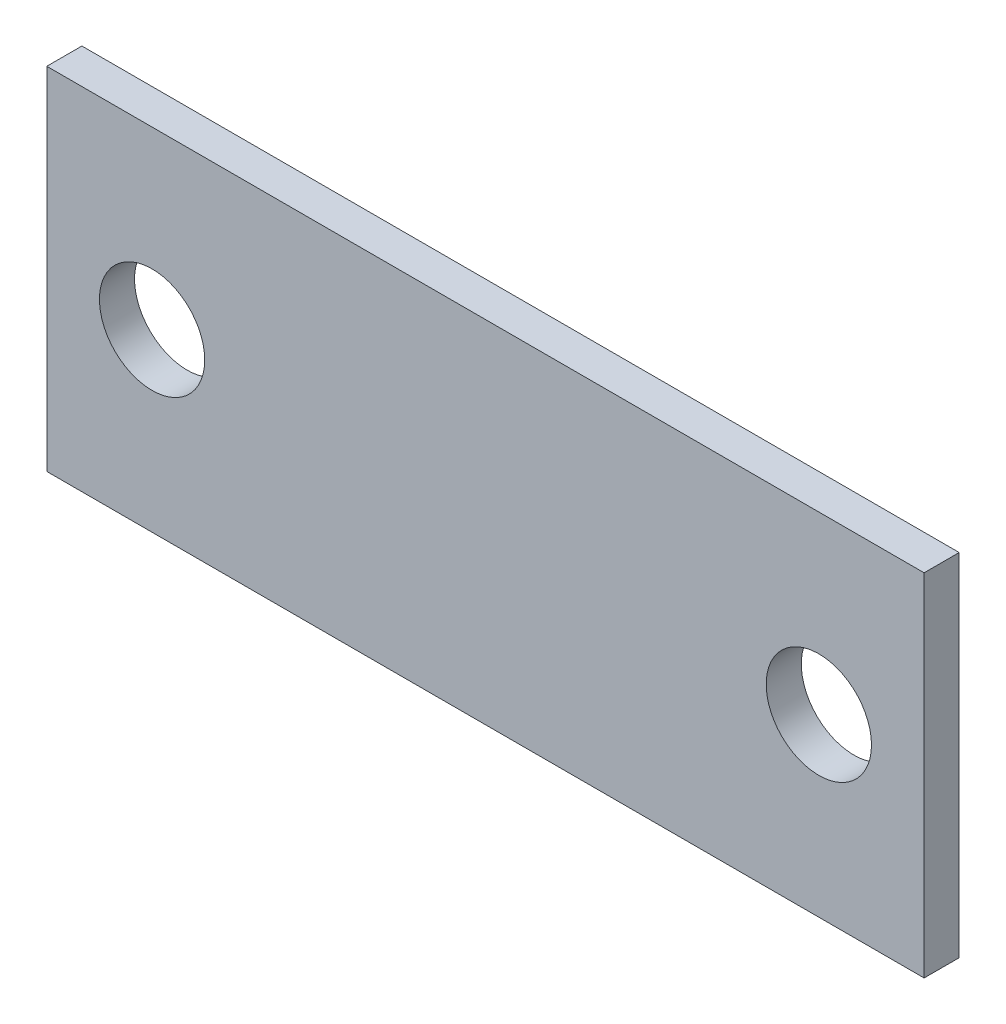
ISO-10303-21;
HEADER;
FILE_DESCRIPTION(('STEP AP214'),'2;1');
FILE_NAME('part.step','',(''),(''),'','','');
FILE_SCHEMA(('AUTOMOTIVE_DESIGN { 1 0 10303 214 1 1 1 1 }'));
ENDSEC;
DATA;
#1=APPLICATION_CONTEXT('core data for automotive mechanical design processes');
#2=APPLICATION_PROTOCOL_DEFINITION('international standard','automotive_design',2000,#1);
#3=PRODUCT_CONTEXT('',#1,'mechanical');
#4=PRODUCT('Part','Part','',(#3));
#5=PRODUCT_RELATED_PRODUCT_CATEGORY('part','',(#4));
#6=PRODUCT_DEFINITION_FORMATION('','',#4);
#7=PRODUCT_DEFINITION_CONTEXT('part definition',#1,'design');
#8=PRODUCT_DEFINITION('design','',#6,#7);
#9=PRODUCT_DEFINITION_SHAPE('','',#8);
#10=(LENGTH_UNIT() NAMED_UNIT(*) SI_UNIT(.MILLI.,.METRE.));
#11=(NAMED_UNIT(*) PLANE_ANGLE_UNIT() SI_UNIT($,.RADIAN.));
#12=(NAMED_UNIT(*) SI_UNIT($,.STERADIAN.) SOLID_ANGLE_UNIT());
#13=UNCERTAINTY_MEASURE_WITH_UNIT(LENGTH_MEASURE(1.E-05),#10,'distance_accuracy_value','');
#14=(GEOMETRIC_REPRESENTATION_CONTEXT(3) GLOBAL_UNCERTAINTY_ASSIGNED_CONTEXT((#13)) GLOBAL_UNIT_ASSIGNED_CONTEXT((#10,
#11,#12)) REPRESENTATION_CONTEXT('',''));
#15=CARTESIAN_POINT('',(0.,0.,0.));
#16=DIRECTION('',(0.,0.,1.));
#17=DIRECTION('',(1.,0.,0.));
#18=AXIS2_PLACEMENT_3D('',#15,#16,#17);
#19=CARTESIAN_POINT('',(0.,0.,10.));
#20=DIRECTION('',(0.,0.,-1.));
#21=DIRECTION('',(-1.,0.,0.));
#22=AXIS2_PLACEMENT_3D('',#19,#20,#21);
#23=PLANE('',#22);
#24=DIRECTION('',(0.,1.,0.));
#25=VECTOR('',#24,1.);
#26=CARTESIAN_POINT('',(125.,-50.,10.));
#27=LINE('',#26,#25);
#28=CARTESIAN_POINT('',(125.,-50.,10.));
#29=VERTEX_POINT('',#28);
#30=CARTESIAN_POINT('',(125.,50.,10.));
#31=VERTEX_POINT('',#30);
#32=EDGE_CURVE('E91',#29,#31,#27,.T.);
#33=ORIENTED_EDGE('',*,*,#32,.T.);
#34=DIRECTION('',(-1.,0.,0.));
#35=VECTOR('',#34,1.);
#36=CARTESIAN_POINT('',(-125.,50.,10.));
#37=LINE('',#36,#35);
#38=CARTESIAN_POINT('',(-125.,50.,10.));
#39=VERTEX_POINT('',#38);
#40=EDGE_CURVE('E86',#31,#39,#37,.T.);
#41=ORIENTED_EDGE('',*,*,#40,.T.);
#42=DIRECTION('',(0.,-1.,0.));
#43=VECTOR('',#42,1.);
#44=CARTESIAN_POINT('',(-125.,-50.,10.));
#45=LINE('',#44,#43);
#46=CARTESIAN_POINT('',(-125.,-50.,10.));
#47=VERTEX_POINT('',#46);
#48=EDGE_CURVE('E89',#39,#47,#45,.T.);
#49=ORIENTED_EDGE('',*,*,#48,.T.);
#50=DIRECTION('',(1.,0.,0.));
#51=VECTOR('',#50,1.);
#52=CARTESIAN_POINT('',(-125.,-50.,10.));
#53=LINE('',#52,#51);
#54=EDGE_CURVE('E56',#47,#29,#53,.T.);
#55=ORIENTED_EDGE('',*,*,#54,.T.);
#56=EDGE_LOOP('',(#33,#41,#49,#55));
#57=FACE_BOUND('',#56,.T.);
#58=CARTESIAN_POINT('',(-95.,0.,10.));
#59=DIRECTION('',(0.,0.,1.));
#60=DIRECTION('',(1.,0.,0.));
#61=AXIS2_PLACEMENT_3D('',#58,#59,#60);
#62=CIRCLE('',#61,15.);
#63=CARTESIAN_POINT('',(-80.,0.,10.));
#64=VERTEX_POINT('',#63);
#65=EDGE_CURVE('E106',#64,#64,#62,.T.);
#66=ORIENTED_EDGE('',*,*,#65,.F.);
#67=EDGE_LOOP('',(#66));
#68=FACE_BOUND('',#67,.T.);
#69=CARTESIAN_POINT('',(95.,0.,10.));
#70=DIRECTION('',(0.,0.,1.));
#71=DIRECTION('',(1.,0.,0.));
#72=AXIS2_PLACEMENT_3D('',#69,#70,#71);
#73=CIRCLE('',#72,15.);
#74=CARTESIAN_POINT('',(110.,0.,10.));
#75=VERTEX_POINT('',#74);
#76=EDGE_CURVE('E121',#75,#75,#73,.T.);
#77=ORIENTED_EDGE('',*,*,#76,.F.);
#78=EDGE_LOOP('',(#77));
#79=FACE_BOUND('',#78,.T.);
#80=ADVANCED_FACE('F39',(#57,#68,#79),#23,.F.);
#81=CARTESIAN_POINT('',(0.,0.,0.));
#82=DIRECTION('',(0.,0.,-1.));
#83=DIRECTION('',(-1.,0.,0.));
#84=AXIS2_PLACEMENT_3D('',#81,#82,#83);
#85=PLANE('',#84);
#86=CARTESIAN_POINT('',(-95.,0.,0.));
#87=DIRECTION('',(0.,0.,1.));
#88=DIRECTION('',(1.,0.,0.));
#89=AXIS2_PLACEMENT_3D('',#86,#87,#88);
#90=CIRCLE('',#89,15.);
#91=CARTESIAN_POINT('',(-80.,0.,0.));
#92=VERTEX_POINT('',#91);
#93=EDGE_CURVE('E118',#92,#92,#90,.T.);
#94=ORIENTED_EDGE('',*,*,#93,.T.);
#95=EDGE_LOOP('',(#94));
#96=FACE_BOUND('',#95,.T.);
#97=DIRECTION('',(0.,1.,0.));
#98=VECTOR('',#97,1.);
#99=CARTESIAN_POINT('',(125.,-50.,0.));
#100=LINE('',#99,#98);
#101=CARTESIAN_POINT('',(125.,-50.,0.));
#102=VERTEX_POINT('',#101);
#103=CARTESIAN_POINT('',(125.,50.,0.));
#104=VERTEX_POINT('',#103);
#105=EDGE_CURVE('E103',#102,#104,#100,.T.);
#106=ORIENTED_EDGE('',*,*,#105,.F.);
#107=DIRECTION('',(1.,0.,0.));
#108=VECTOR('',#107,1.);
#109=CARTESIAN_POINT('',(-125.,-50.,0.));
#110=LINE('',#109,#108);
#111=CARTESIAN_POINT('',(-125.,-50.,0.));
#112=VERTEX_POINT('',#111);
#113=EDGE_CURVE('E79',#112,#102,#110,.T.);
#114=ORIENTED_EDGE('',*,*,#113,.F.);
#115=DIRECTION('',(0.,-1.,0.));
#116=VECTOR('',#115,1.);
#117=CARTESIAN_POINT('',(-125.,-50.,0.));
#118=LINE('',#117,#116);
#119=CARTESIAN_POINT('',(-125.,50.,0.));
#120=VERTEX_POINT('',#119);
#121=EDGE_CURVE('E73',#120,#112,#118,.T.);
#122=ORIENTED_EDGE('',*,*,#121,.F.);
#123=DIRECTION('',(-1.,0.,0.));
#124=VECTOR('',#123,1.);
#125=CARTESIAN_POINT('',(-125.,50.,0.));
#126=LINE('',#125,#124);
#127=EDGE_CURVE('E95',#104,#120,#126,.T.);
#128=ORIENTED_EDGE('',*,*,#127,.F.);
#129=EDGE_LOOP('',(#106,#114,#122,#128));
#130=FACE_BOUND('',#129,.T.);
#131=CARTESIAN_POINT('',(95.,0.,0.));
#132=DIRECTION('',(0.,0.,1.));
#133=DIRECTION('',(1.,0.,0.));
#134=AXIS2_PLACEMENT_3D('',#131,#132,#133);
#135=CIRCLE('',#134,15.);
#136=CARTESIAN_POINT('',(110.,0.,0.));
#137=VERTEX_POINT('',#136);
#138=EDGE_CURVE('E124',#137,#137,#135,.T.);
#139=ORIENTED_EDGE('',*,*,#138,.T.);
#140=EDGE_LOOP('',(#139));
#141=FACE_BOUND('',#140,.T.);
#142=ADVANCED_FACE('F114',(#96,#130,#141),#85,.T.);
#143=CARTESIAN_POINT('',(125.,-50.,10.));
#144=DIRECTION('',(-1.,0.,0.));
#145=DIRECTION('',(0.,0.,1.));
#146=AXIS2_PLACEMENT_3D('',#143,#144,#145);
#147=PLANE('',#146);
#148=ORIENTED_EDGE('',*,*,#105,.T.);
#149=DIRECTION('',(0.,0.,-1.));
#150=VECTOR('',#149,1.);
#151=CARTESIAN_POINT('',(125.,50.,10.));
#152=LINE('',#151,#150);
#153=EDGE_CURVE('E11',#31,#104,#152,.T.);
#154=ORIENTED_EDGE('',*,*,#153,.F.);
#155=ORIENTED_EDGE('',*,*,#32,.F.);
#156=DIRECTION('',(0.,0.,-1.));
#157=VECTOR('',#156,1.);
#158=CARTESIAN_POINT('',(125.,-50.,10.));
#159=LINE('',#158,#157);
#160=EDGE_CURVE('E99',#29,#102,#159,.T.);
#161=ORIENTED_EDGE('',*,*,#160,.T.);
#162=EDGE_LOOP('',(#148,#154,#155,#161));
#163=FACE_BOUND('',#162,.T.);
#164=ADVANCED_FACE('F41',(#163),#147,.F.);
#165=CARTESIAN_POINT('',(-125.,50.,10.));
#166=DIRECTION('',(0.,-1.,0.));
#167=DIRECTION('',(0.,0.,-1.));
#168=AXIS2_PLACEMENT_3D('',#165,#166,#167);
#169=PLANE('',#168);
#170=ORIENTED_EDGE('',*,*,#127,.T.);
#171=DIRECTION('',(0.,0.,-1.));
#172=VECTOR('',#171,1.);
#173=CARTESIAN_POINT('',(-125.,50.,10.));
#174=LINE('',#173,#172);
#175=EDGE_CURVE('E48',#39,#120,#174,.T.);
#176=ORIENTED_EDGE('',*,*,#175,.F.);
#177=ORIENTED_EDGE('',*,*,#40,.F.);
#178=ORIENTED_EDGE('',*,*,#153,.T.);
#179=EDGE_LOOP('',(#170,#176,#177,#178));
#180=FACE_BOUND('',#179,.T.);
#181=ADVANCED_FACE('F94',(#180),#169,.F.);
#182=CARTESIAN_POINT('',(-125.,-50.,10.));
#183=DIRECTION('',(1.,0.,0.));
#184=DIRECTION('',(0.,0.,-1.));
#185=AXIS2_PLACEMENT_3D('',#182,#183,#184);
#186=PLANE('',#185);
#187=ORIENTED_EDGE('',*,*,#121,.T.);
#188=DIRECTION('',(0.,0.,-1.));
#189=VECTOR('',#188,1.);
#190=CARTESIAN_POINT('',(-125.,-50.,10.));
#191=LINE('',#190,#189);
#192=EDGE_CURVE('E96',#47,#112,#191,.T.);
#193=ORIENTED_EDGE('',*,*,#192,.F.);
#194=ORIENTED_EDGE('',*,*,#48,.F.);
#195=ORIENTED_EDGE('',*,*,#175,.T.);
#196=EDGE_LOOP('',(#187,#193,#194,#195));
#197=FACE_BOUND('',#196,.T.);
#198=ADVANCED_FACE('F97',(#197),#186,.F.);
#199=CARTESIAN_POINT('',(-125.,-50.,10.));
#200=DIRECTION('',(0.,1.,0.));
#201=DIRECTION('',(0.,0.,1.));
#202=AXIS2_PLACEMENT_3D('',#199,#200,#201);
#203=PLANE('',#202);
#204=ORIENTED_EDGE('',*,*,#113,.T.);
#205=ORIENTED_EDGE('',*,*,#160,.F.);
#206=ORIENTED_EDGE('',*,*,#54,.F.);
#207=ORIENTED_EDGE('',*,*,#192,.T.);
#208=EDGE_LOOP('',(#204,#205,#206,#207));
#209=FACE_BOUND('',#208,.T.);
#210=ADVANCED_FACE('F111',(#209),#203,.F.);
#211=CARTESIAN_POINT('',(-95.,0.,10.));
#212=DIRECTION('',(0.,0.,-1.));
#213=DIRECTION('',(-1.,0.,0.));
#214=AXIS2_PLACEMENT_3D('',#211,#212,#213);
#215=CYLINDRICAL_SURFACE('',#214,15.);
#216=ORIENTED_EDGE('',*,*,#65,.T.);
#217=EDGE_LOOP('',(#216));
#218=FACE_BOUND('',#217,.T.);
#219=ORIENTED_EDGE('',*,*,#93,.F.);
#220=EDGE_LOOP('',(#219));
#221=FACE_BOUND('',#220,.T.);
#222=ADVANCED_FACE('F141',(#218,#221),#215,.F.);
#223=CARTESIAN_POINT('',(95.,0.,10.));
#224=DIRECTION('',(0.,0.,-1.));
#225=DIRECTION('',(-1.,0.,0.));
#226=AXIS2_PLACEMENT_3D('',#223,#224,#225);
#227=CYLINDRICAL_SURFACE('',#226,15.);
#228=ORIENTED_EDGE('',*,*,#76,.T.);
#229=EDGE_LOOP('',(#228));
#230=FACE_BOUND('',#229,.T.);
#231=ORIENTED_EDGE('',*,*,#138,.F.);
#232=EDGE_LOOP('',(#231));
#233=FACE_BOUND('',#232,.T.);
#234=ADVANCED_FACE('F130',(#230,#233),#227,.F.);
#235=CLOSED_SHELL('',(#80,#142,#164,#181,#198,#210,#222,#234));
#236=MANIFOLD_SOLID_BREP('B2',#235);
#237=ADVANCED_BREP_SHAPE_REPRESENTATION('',(#18,#236),#14);
#238=SHAPE_DEFINITION_REPRESENTATION(#9,#237);
ENDSEC;
END-ISO-10303-21;
